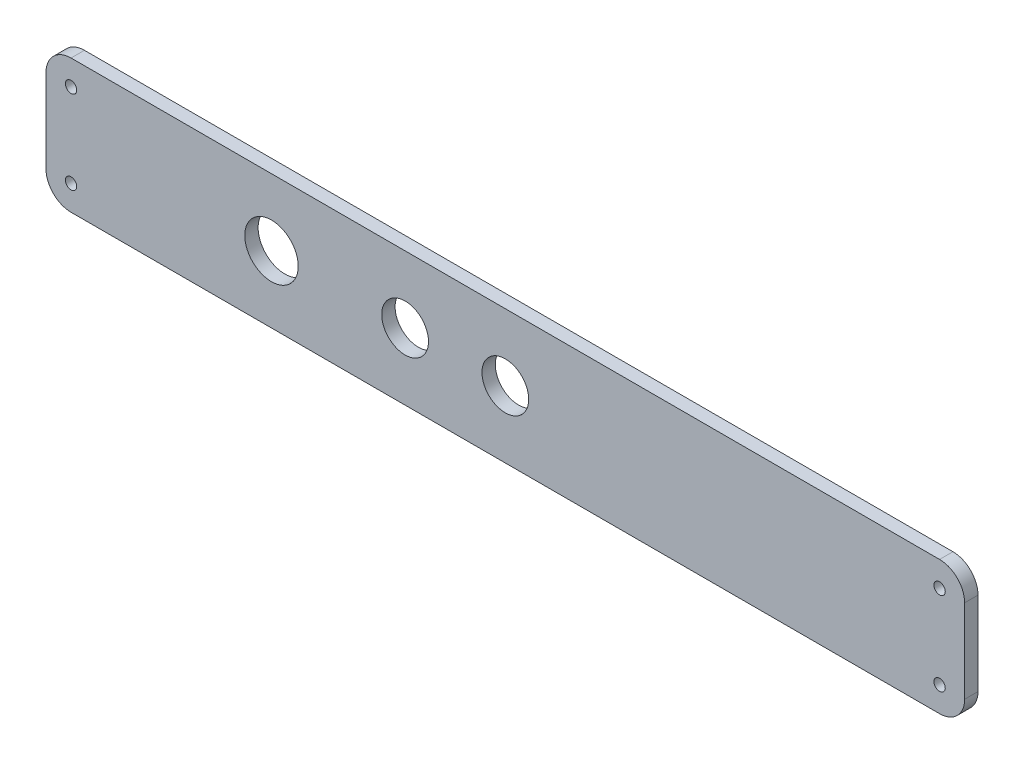
ISO-10303-21;
HEADER;
FILE_DESCRIPTION(('STEP AP214'),'2;1');
FILE_NAME('part.step','',(''),(''),'','','');
FILE_SCHEMA(('AUTOMOTIVE_DESIGN { 1 0 10303 214 1 1 1 1 }'));
ENDSEC;
DATA;
#1=APPLICATION_CONTEXT('core data for automotive mechanical design processes');
#2=APPLICATION_PROTOCOL_DEFINITION('international standard','automotive_design',2000,#1);
#3=PRODUCT_CONTEXT('',#1,'mechanical');
#4=PRODUCT('Part','Part','',(#3));
#5=PRODUCT_RELATED_PRODUCT_CATEGORY('part','',(#4));
#6=PRODUCT_DEFINITION_FORMATION('','',#4);
#7=PRODUCT_DEFINITION_CONTEXT('part definition',#1,'design');
#8=PRODUCT_DEFINITION('design','',#6,#7);
#9=PRODUCT_DEFINITION_SHAPE('','',#8);
#10=(LENGTH_UNIT() NAMED_UNIT(*) SI_UNIT(.MILLI.,.METRE.));
#11=(NAMED_UNIT(*) PLANE_ANGLE_UNIT() SI_UNIT($,.RADIAN.));
#12=(NAMED_UNIT(*) SI_UNIT($,.STERADIAN.) SOLID_ANGLE_UNIT());
#13=UNCERTAINTY_MEASURE_WITH_UNIT(LENGTH_MEASURE(1.E-05),#10,'distance_accuracy_value','');
#14=(GEOMETRIC_REPRESENTATION_CONTEXT(3) GLOBAL_UNCERTAINTY_ASSIGNED_CONTEXT((#13)) GLOBAL_UNIT_ASSIGNED_CONTEXT((#10,
#11,#12)) REPRESENTATION_CONTEXT('',''));
#15=CARTESIAN_POINT('',(0.,0.,0.));
#16=DIRECTION('',(0.,0.,1.));
#17=DIRECTION('',(1.,0.,0.));
#18=AXIS2_PLACEMENT_3D('',#15,#16,#17);
#19=CARTESIAN_POINT('',(0.,0.,0.));
#20=DIRECTION('',(0.,0.,-1.));
#21=DIRECTION('',(-1.,0.,0.));
#22=AXIS2_PLACEMENT_3D('',#19,#20,#21);
#23=PLANE('',#22);
#24=CARTESIAN_POINT('',(-267.5,32.5,0.));
#25=DIRECTION('',(0.,0.,1.));
#26=DIRECTION('',(1.,0.,0.));
#27=AXIS2_PLACEMENT_3D('',#24,#25,#26);
#28=CIRCLE('',#27,1.69999999999998);
#29=CARTESIAN_POINT('',(-265.8,32.5,0.));
#30=VERTEX_POINT('',#29);
#31=EDGE_CURVE('E222',#30,#30,#28,.T.);
#32=ORIENTED_EDGE('',*,*,#31,.T.);
#33=EDGE_LOOP('',(#32));
#34=FACE_BOUND('',#33,.T.);
#35=CARTESIAN_POINT('',(-267.5,7.49999999999998,0.));
#36=DIRECTION('',(0.,0.,1.));
#37=DIRECTION('',(1.,0.,0.));
#38=AXIS2_PLACEMENT_3D('',#35,#36,#37);
#39=CIRCLE('',#38,1.69999999999998);
#40=CARTESIAN_POINT('',(-265.8,7.49999999999998,0.));
#41=VERTEX_POINT('',#40);
#42=EDGE_CURVE('E216',#41,#41,#39,.T.);
#43=ORIENTED_EDGE('',*,*,#42,.T.);
#44=EDGE_LOOP('',(#43));
#45=FACE_BOUND('',#44,.T.);
#46=CARTESIAN_POINT('',(-7.50000000000001,32.5,0.));
#47=DIRECTION('',(0.,0.,1.));
#48=DIRECTION('',(1.,0.,0.));
#49=AXIS2_PLACEMENT_3D('',#46,#47,#48);
#50=CIRCLE('',#49,1.7);
#51=CARTESIAN_POINT('',(-5.80000000000001,32.5,0.));
#52=VERTEX_POINT('',#51);
#53=EDGE_CURVE('E194',#52,#52,#50,.T.);
#54=ORIENTED_EDGE('',*,*,#53,.T.);
#55=EDGE_LOOP('',(#54));
#56=FACE_BOUND('',#55,.T.);
#57=CARTESIAN_POINT('',(-207.5,20.,0.));
#58=DIRECTION('',(0.,0.,1.));
#59=DIRECTION('',(1.,0.,0.));
#60=AXIS2_PLACEMENT_3D('',#57,#58,#59);
#61=CIRCLE('',#60,8.00000000000001);
#62=CARTESIAN_POINT('',(-199.5,20.,0.));
#63=VERTEX_POINT('',#62);
#64=EDGE_CURVE('E182',#63,#63,#61,.T.);
#65=ORIENTED_EDGE('',*,*,#64,.T.);
#66=EDGE_LOOP('',(#65));
#67=FACE_BOUND('',#66,.T.);
#68=CARTESIAN_POINT('',(-167.5,20.,0.));
#69=DIRECTION('',(0.,0.,1.));
#70=DIRECTION('',(1.,0.,0.));
#71=AXIS2_PLACEMENT_3D('',#68,#69,#70);
#72=CIRCLE('',#71,7.00000000000001);
#73=CARTESIAN_POINT('',(-160.5,20.,0.));
#74=VERTEX_POINT('',#73);
#75=EDGE_CURVE('E197',#74,#74,#72,.T.);
#76=ORIENTED_EDGE('',*,*,#75,.T.);
#77=EDGE_LOOP('',(#76));
#78=FACE_BOUND('',#77,.T.);
#79=CARTESIAN_POINT('',(-137.5,20.,0.));
#80=DIRECTION('',(0.,0.,1.));
#81=DIRECTION('',(1.,0.,0.));
#82=AXIS2_PLACEMENT_3D('',#79,#80,#81);
#83=CIRCLE('',#82,7.00000000000001);
#84=CARTESIAN_POINT('',(-130.5,20.,0.));
#85=VERTEX_POINT('',#84);
#86=EDGE_CURVE('E190',#85,#85,#83,.T.);
#87=ORIENTED_EDGE('',*,*,#86,.T.);
#88=EDGE_LOOP('',(#87));
#89=FACE_BOUND('',#88,.T.);
#90=DIRECTION('',(-1.,0.,0.));
#91=VECTOR('',#90,1.);
#92=CARTESIAN_POINT('',(0.,40.,0.));
#93=LINE('',#92,#91);
#94=CARTESIAN_POINT('',(-7.5,40.,0.));
#95=VERTEX_POINT('',#94);
#96=CARTESIAN_POINT('',(-267.5,40.,0.));
#97=VERTEX_POINT('',#96);
#98=EDGE_CURVE('E124',#95,#97,#93,.T.);
#99=ORIENTED_EDGE('',*,*,#98,.F.);
#100=CARTESIAN_POINT('',(-7.5,32.5,0.));
#101=DIRECTION('',(0.,0.,-1.));
#102=DIRECTION('',(-1.,0.,0.));
#103=AXIS2_PLACEMENT_3D('',#100,#101,#102);
#104=CIRCLE('',#103,7.5);
#105=CARTESIAN_POINT('',(0.,32.5,0.));
#106=VERTEX_POINT('',#105);
#107=EDGE_CURVE('E107',#95,#106,#104,.T.);
#108=ORIENTED_EDGE('',*,*,#107,.T.);
#109=DIRECTION('',(0.,1.,0.));
#110=VECTOR('',#109,1.);
#111=CARTESIAN_POINT('',(0.,0.,0.));
#112=LINE('',#111,#110);
#113=CARTESIAN_POINT('',(0.,7.5,0.));
#114=VERTEX_POINT('',#113);
#115=EDGE_CURVE('E134',#114,#106,#112,.T.);
#116=ORIENTED_EDGE('',*,*,#115,.F.);
#117=CARTESIAN_POINT('',(-7.5,7.5,0.));
#118=DIRECTION('',(0.,0.,-1.));
#119=DIRECTION('',(-1.,0.,0.));
#120=AXIS2_PLACEMENT_3D('',#117,#118,#119);
#121=CIRCLE('',#120,7.5);
#122=CARTESIAN_POINT('',(-7.5,0.,0.));
#123=VERTEX_POINT('',#122);
#124=EDGE_CURVE('E118',#114,#123,#121,.T.);
#125=ORIENTED_EDGE('',*,*,#124,.T.);
#126=DIRECTION('',(1.,0.,0.));
#127=VECTOR('',#126,1.);
#128=CARTESIAN_POINT('',(0.,0.,0.));
#129=LINE('',#128,#127);
#130=CARTESIAN_POINT('',(-267.5,0.,0.));
#131=VERTEX_POINT('',#130);
#132=EDGE_CURVE('E138',#131,#123,#129,.T.);
#133=ORIENTED_EDGE('',*,*,#132,.F.);
#134=CARTESIAN_POINT('',(-267.5,7.49999999999998,0.));
#135=DIRECTION('',(0.,0.,-1.));
#136=DIRECTION('',(-1.,0.,0.));
#137=AXIS2_PLACEMENT_3D('',#134,#135,#136);
#138=CIRCLE('',#137,7.5);
#139=CARTESIAN_POINT('',(-275.,7.49999999999998,0.));
#140=VERTEX_POINT('',#139);
#141=EDGE_CURVE('E127',#131,#140,#138,.T.);
#142=ORIENTED_EDGE('',*,*,#141,.T.);
#143=DIRECTION('',(0.,-1.,0.));
#144=VECTOR('',#143,1.);
#145=CARTESIAN_POINT('',(-275.,0.,0.));
#146=LINE('',#145,#144);
#147=CARTESIAN_POINT('',(-275.,32.5,0.));
#148=VERTEX_POINT('',#147);
#149=EDGE_CURVE('E133',#148,#140,#146,.T.);
#150=ORIENTED_EDGE('',*,*,#149,.F.);
#151=CARTESIAN_POINT('',(-267.5,32.5,0.));
#152=DIRECTION('',(0.,0.,-1.));
#153=DIRECTION('',(-1.,0.,0.));
#154=AXIS2_PLACEMENT_3D('',#151,#152,#153);
#155=CIRCLE('',#154,7.5);
#156=EDGE_CURVE('E132',#148,#97,#155,.T.);
#157=ORIENTED_EDGE('',*,*,#156,.T.);
#158=EDGE_LOOP('',(#99,#108,#116,#125,#133,#142,#150,#157));
#159=FACE_BOUND('',#158,.T.);
#160=CARTESIAN_POINT('',(-7.50000000000006,7.49999999999998,0.));
#161=DIRECTION('',(0.,0.,1.));
#162=DIRECTION('',(1.,0.,0.));
#163=AXIS2_PLACEMENT_3D('',#160,#161,#162);
#164=CIRCLE('',#163,1.7);
#165=CARTESIAN_POINT('',(-5.80000000000006,7.49999999999998,0.));
#166=VERTEX_POINT('',#165);
#167=EDGE_CURVE('E210',#166,#166,#164,.T.);
#168=ORIENTED_EDGE('',*,*,#167,.T.);
#169=EDGE_LOOP('',(#168));
#170=FACE_BOUND('',#169,.T.);
#171=ADVANCED_FACE('F41',(#34,#45,#56,#67,#78,#89,#159,#170),#23,.T.);
#172=CARTESIAN_POINT('',(0.,0.,4.));
#173=DIRECTION('',(0.,0.,-1.));
#174=DIRECTION('',(-1.,0.,0.));
#175=AXIS2_PLACEMENT_3D('',#172,#173,#174);
#176=PLANE('',#175);
#177=CARTESIAN_POINT('',(-267.5,32.5,4.));
#178=DIRECTION('',(0.,0.,1.));
#179=DIRECTION('',(1.,0.,0.));
#180=AXIS2_PLACEMENT_3D('',#177,#178,#179);
#181=CIRCLE('',#180,1.69999999999998);
#182=CARTESIAN_POINT('',(-265.8,32.5,4.));
#183=VERTEX_POINT('',#182);
#184=EDGE_CURVE('E225',#183,#183,#181,.T.);
#185=ORIENTED_EDGE('',*,*,#184,.F.);
#186=EDGE_LOOP('',(#185));
#187=FACE_BOUND('',#186,.T.);
#188=CARTESIAN_POINT('',(-267.5,7.49999999999998,4.));
#189=DIRECTION('',(0.,0.,1.));
#190=DIRECTION('',(1.,0.,0.));
#191=AXIS2_PLACEMENT_3D('',#188,#189,#190);
#192=CIRCLE('',#191,1.69999999999998);
#193=CARTESIAN_POINT('',(-265.8,7.49999999999998,4.));
#194=VERTEX_POINT('',#193);
#195=EDGE_CURVE('E219',#194,#194,#192,.T.);
#196=ORIENTED_EDGE('',*,*,#195,.F.);
#197=EDGE_LOOP('',(#196));
#198=FACE_BOUND('',#197,.T.);
#199=CARTESIAN_POINT('',(-7.50000000000006,7.49999999999998,4.));
#200=DIRECTION('',(0.,0.,1.));
#201=DIRECTION('',(1.,0.,0.));
#202=AXIS2_PLACEMENT_3D('',#199,#200,#201);
#203=CIRCLE('',#202,1.7);
#204=CARTESIAN_POINT('',(-5.80000000000006,7.49999999999998,4.));
#205=VERTEX_POINT('',#204);
#206=EDGE_CURVE('E213',#205,#205,#203,.T.);
#207=ORIENTED_EDGE('',*,*,#206,.F.);
#208=EDGE_LOOP('',(#207));
#209=FACE_BOUND('',#208,.T.);
#210=CARTESIAN_POINT('',(-207.5,20.,4.));
#211=DIRECTION('',(0.,0.,1.));
#212=DIRECTION('',(1.,0.,0.));
#213=AXIS2_PLACEMENT_3D('',#210,#211,#212);
#214=CIRCLE('',#213,8.00000000000001);
#215=CARTESIAN_POINT('',(-199.5,20.,4.));
#216=VERTEX_POINT('',#215);
#217=EDGE_CURVE('E184',#216,#216,#214,.T.);
#218=ORIENTED_EDGE('',*,*,#217,.F.);
#219=EDGE_LOOP('',(#218));
#220=FACE_BOUND('',#219,.T.);
#221=CARTESIAN_POINT('',(-167.5,20.,4.));
#222=DIRECTION('',(0.,0.,1.));
#223=DIRECTION('',(1.,0.,0.));
#224=AXIS2_PLACEMENT_3D('',#221,#222,#223);
#225=CIRCLE('',#224,7.00000000000001);
#226=CARTESIAN_POINT('',(-160.5,20.,4.));
#227=VERTEX_POINT('',#226);
#228=EDGE_CURVE('E200',#227,#227,#225,.T.);
#229=ORIENTED_EDGE('',*,*,#228,.F.);
#230=EDGE_LOOP('',(#229));
#231=FACE_BOUND('',#230,.T.);
#232=CARTESIAN_POINT('',(-137.5,20.,4.));
#233=DIRECTION('',(0.,0.,1.));
#234=DIRECTION('',(1.,0.,0.));
#235=AXIS2_PLACEMENT_3D('',#232,#233,#234);
#236=CIRCLE('',#235,7.00000000000001);
#237=CARTESIAN_POINT('',(-130.5,20.,4.));
#238=VERTEX_POINT('',#237);
#239=EDGE_CURVE('E193',#238,#238,#236,.T.);
#240=ORIENTED_EDGE('',*,*,#239,.F.);
#241=EDGE_LOOP('',(#240));
#242=FACE_BOUND('',#241,.T.);
#243=DIRECTION('',(0.,1.,0.));
#244=VECTOR('',#243,1.);
#245=CARTESIAN_POINT('',(0.,0.,4.));
#246=LINE('',#245,#244);
#247=CARTESIAN_POINT('',(0.,7.5,4.));
#248=VERTEX_POINT('',#247);
#249=CARTESIAN_POINT('',(0.,32.5,4.));
#250=VERTEX_POINT('',#249);
#251=EDGE_CURVE('E176',#248,#250,#246,.T.);
#252=ORIENTED_EDGE('',*,*,#251,.T.);
#253=CARTESIAN_POINT('',(-7.5,32.5,4.));
#254=DIRECTION('',(0.,0.,-1.));
#255=DIRECTION('',(-1.,0.,0.));
#256=AXIS2_PLACEMENT_3D('',#253,#254,#255);
#257=CIRCLE('',#256,7.5);
#258=CARTESIAN_POINT('',(-7.5,40.,4.));
#259=VERTEX_POINT('',#258);
#260=EDGE_CURVE('E155',#250,#259,#257,.F.);
#261=ORIENTED_EDGE('',*,*,#260,.T.);
#262=DIRECTION('',(-1.,0.,0.));
#263=VECTOR('',#262,1.);
#264=CARTESIAN_POINT('',(0.,40.,4.));
#265=LINE('',#264,#263);
#266=CARTESIAN_POINT('',(-267.5,40.,4.));
#267=VERTEX_POINT('',#266);
#268=EDGE_CURVE('E126',#259,#267,#265,.T.);
#269=ORIENTED_EDGE('',*,*,#268,.T.);
#270=CARTESIAN_POINT('',(-267.5,32.5,4.));
#271=DIRECTION('',(0.,0.,-1.));
#272=DIRECTION('',(-1.,0.,0.));
#273=AXIS2_PLACEMENT_3D('',#270,#271,#272);
#274=CIRCLE('',#273,7.5);
#275=CARTESIAN_POINT('',(-275.,32.5,4.));
#276=VERTEX_POINT('',#275);
#277=EDGE_CURVE('E62',#267,#276,#274,.F.);
#278=ORIENTED_EDGE('',*,*,#277,.T.);
#279=DIRECTION('',(0.,-1.,0.));
#280=VECTOR('',#279,1.);
#281=CARTESIAN_POINT('',(-275.,0.,4.));
#282=LINE('',#281,#280);
#283=CARTESIAN_POINT('',(-275.,7.49999999999998,4.));
#284=VERTEX_POINT('',#283);
#285=EDGE_CURVE('E142',#276,#284,#282,.T.);
#286=ORIENTED_EDGE('',*,*,#285,.T.);
#287=CARTESIAN_POINT('',(-267.5,7.49999999999998,4.));
#288=DIRECTION('',(0.,0.,-1.));
#289=DIRECTION('',(-1.,0.,0.));
#290=AXIS2_PLACEMENT_3D('',#287,#288,#289);
#291=CIRCLE('',#290,7.5);
#292=CARTESIAN_POINT('',(-267.5,0.,4.));
#293=VERTEX_POINT('',#292);
#294=EDGE_CURVE('E150',#284,#293,#291,.F.);
#295=ORIENTED_EDGE('',*,*,#294,.T.);
#296=DIRECTION('',(1.,0.,0.));
#297=VECTOR('',#296,1.);
#298=CARTESIAN_POINT('',(0.,0.,4.));
#299=LINE('',#298,#297);
#300=CARTESIAN_POINT('',(-7.5,0.,4.));
#301=VERTEX_POINT('',#300);
#302=EDGE_CURVE('E136',#293,#301,#299,.T.);
#303=ORIENTED_EDGE('',*,*,#302,.T.);
#304=CARTESIAN_POINT('',(-7.5,7.5,4.));
#305=DIRECTION('',(0.,0.,-1.));
#306=DIRECTION('',(-1.,0.,0.));
#307=AXIS2_PLACEMENT_3D('',#304,#305,#306);
#308=CIRCLE('',#307,7.5);
#309=EDGE_CURVE('E153',#301,#248,#308,.F.);
#310=ORIENTED_EDGE('',*,*,#309,.T.);
#311=EDGE_LOOP('',(#252,#261,#269,#278,#286,#295,#303,#310));
#312=FACE_BOUND('',#311,.T.);
#313=CARTESIAN_POINT('',(-7.50000000000001,32.5,4.));
#314=DIRECTION('',(0.,0.,1.));
#315=DIRECTION('',(1.,0.,0.));
#316=AXIS2_PLACEMENT_3D('',#313,#314,#315);
#317=CIRCLE('',#316,1.7);
#318=CARTESIAN_POINT('',(-5.80000000000001,32.5,4.));
#319=VERTEX_POINT('',#318);
#320=EDGE_CURVE('E207',#319,#319,#317,.T.);
#321=ORIENTED_EDGE('',*,*,#320,.F.);
#322=EDGE_LOOP('',(#321));
#323=FACE_BOUND('',#322,.T.);
#324=ADVANCED_FACE('F172',(#187,#198,#209,#220,#231,#242,#312,#323),#176,.F.);
#325=CARTESIAN_POINT('',(0.,0.,4.));
#326=DIRECTION('',(0.,1.,0.));
#327=DIRECTION('',(-1.,0.,0.));
#328=AXIS2_PLACEMENT_3D('',#325,#326,#327);
#329=PLANE('',#328);
#330=ORIENTED_EDGE('',*,*,#132,.T.);
#331=DIRECTION('',(0.,0.,-1.));
#332=VECTOR('',#331,1.);
#333=CARTESIAN_POINT('',(-7.5,0.,4.));
#334=LINE('',#333,#332);
#335=EDGE_CURVE('E160',#123,#301,#334,.F.);
#336=ORIENTED_EDGE('',*,*,#335,.T.);
#337=ORIENTED_EDGE('',*,*,#302,.F.);
#338=DIRECTION('',(0.,0.,-1.));
#339=VECTOR('',#338,1.);
#340=CARTESIAN_POINT('',(-267.5,0.,4.));
#341=LINE('',#340,#339);
#342=EDGE_CURVE('E157',#293,#131,#341,.T.);
#343=ORIENTED_EDGE('',*,*,#342,.T.);
#344=EDGE_LOOP('',(#330,#336,#337,#343));
#345=FACE_BOUND('',#344,.T.);
#346=ADVANCED_FACE('F166',(#345),#329,.F.);
#347=CARTESIAN_POINT('',(0.,0.,4.));
#348=DIRECTION('',(-1.,0.,0.));
#349=DIRECTION('',(0.,0.,1.));
#350=AXIS2_PLACEMENT_3D('',#347,#348,#349);
#351=PLANE('',#350);
#352=ORIENTED_EDGE('',*,*,#115,.T.);
#353=DIRECTION('',(0.,0.,-1.));
#354=VECTOR('',#353,1.);
#355=CARTESIAN_POINT('',(0.,32.5,4.));
#356=LINE('',#355,#354);
#357=EDGE_CURVE('E112',#106,#250,#356,.F.);
#358=ORIENTED_EDGE('',*,*,#357,.T.);
#359=ORIENTED_EDGE('',*,*,#251,.F.);
#360=DIRECTION('',(0.,0.,-1.));
#361=VECTOR('',#360,1.);
#362=CARTESIAN_POINT('',(0.,7.5,4.));
#363=LINE('',#362,#361);
#364=EDGE_CURVE('E117',#248,#114,#363,.T.);
#365=ORIENTED_EDGE('',*,*,#364,.T.);
#366=EDGE_LOOP('',(#352,#358,#359,#365));
#367=FACE_BOUND('',#366,.T.);
#368=ADVANCED_FACE('F181',(#367),#351,.F.);
#369=CARTESIAN_POINT('',(0.,40.,4.));
#370=DIRECTION('',(0.,-1.,0.));
#371=DIRECTION('',(1.,0.,0.));
#372=AXIS2_PLACEMENT_3D('',#369,#370,#371);
#373=PLANE('',#372);
#374=ORIENTED_EDGE('',*,*,#268,.F.);
#375=DIRECTION('',(0.,0.,-1.));
#376=VECTOR('',#375,1.);
#377=CARTESIAN_POINT('',(-7.5,40.,4.));
#378=LINE('',#377,#376);
#379=EDGE_CURVE('E111',#259,#95,#378,.T.);
#380=ORIENTED_EDGE('',*,*,#379,.T.);
#381=ORIENTED_EDGE('',*,*,#98,.T.);
#382=DIRECTION('',(0.,0.,-1.));
#383=VECTOR('',#382,1.);
#384=CARTESIAN_POINT('',(-267.5,40.,4.));
#385=LINE('',#384,#383);
#386=EDGE_CURVE('E128',#97,#267,#385,.F.);
#387=ORIENTED_EDGE('',*,*,#386,.T.);
#388=EDGE_LOOP('',(#374,#380,#381,#387));
#389=FACE_BOUND('',#388,.T.);
#390=ADVANCED_FACE('F123',(#389),#373,.F.);
#391=CARTESIAN_POINT('',(-275.,0.,4.));
#392=DIRECTION('',(1.,0.,0.));
#393=DIRECTION('',(0.,0.,-1.));
#394=AXIS2_PLACEMENT_3D('',#391,#392,#393);
#395=PLANE('',#394);
#396=ORIENTED_EDGE('',*,*,#285,.F.);
#397=DIRECTION('',(0.,0.,-1.));
#398=VECTOR('',#397,1.);
#399=CARTESIAN_POINT('',(-275.,32.5,4.));
#400=LINE('',#399,#398);
#401=EDGE_CURVE('E11',#276,#148,#400,.T.);
#402=ORIENTED_EDGE('',*,*,#401,.T.);
#403=ORIENTED_EDGE('',*,*,#149,.T.);
#404=DIRECTION('',(0.,0.,-1.));
#405=VECTOR('',#404,1.);
#406=CARTESIAN_POINT('',(-275.,7.49999999999998,4.));
#407=LINE('',#406,#405);
#408=EDGE_CURVE('E49',#140,#284,#407,.F.);
#409=ORIENTED_EDGE('',*,*,#408,.T.);
#410=EDGE_LOOP('',(#396,#402,#403,#409));
#411=FACE_BOUND('',#410,.T.);
#412=ADVANCED_FACE('F247',(#411),#395,.F.);
#413=CARTESIAN_POINT('',(-137.5,20.,0.));
#414=DIRECTION('',(0.,0.,1.));
#415=DIRECTION('',(1.,0.,0.));
#416=AXIS2_PLACEMENT_3D('',#413,#414,#415);
#417=CYLINDRICAL_SURFACE('',#416,7.00000000000001);
#418=ORIENTED_EDGE('',*,*,#86,.F.);
#419=EDGE_LOOP('',(#418));
#420=FACE_BOUND('',#419,.T.);
#421=ORIENTED_EDGE('',*,*,#239,.T.);
#422=EDGE_LOOP('',(#421));
#423=FACE_BOUND('',#422,.T.);
#424=ADVANCED_FACE('F244',(#420,#423),#417,.F.);
#425=CARTESIAN_POINT('',(-167.5,20.,0.));
#426=DIRECTION('',(0.,0.,1.));
#427=DIRECTION('',(1.,0.,0.));
#428=AXIS2_PLACEMENT_3D('',#425,#426,#427);
#429=CYLINDRICAL_SURFACE('',#428,7.00000000000001);
#430=ORIENTED_EDGE('',*,*,#75,.F.);
#431=EDGE_LOOP('',(#430));
#432=FACE_BOUND('',#431,.T.);
#433=ORIENTED_EDGE('',*,*,#228,.T.);
#434=EDGE_LOOP('',(#433));
#435=FACE_BOUND('',#434,.T.);
#436=ADVANCED_FACE('F246',(#432,#435),#429,.F.);
#437=CARTESIAN_POINT('',(-207.5,20.,0.));
#438=DIRECTION('',(0.,0.,1.));
#439=DIRECTION('',(1.,0.,0.));
#440=AXIS2_PLACEMENT_3D('',#437,#438,#439);
#441=CYLINDRICAL_SURFACE('',#440,8.00000000000001);
#442=ORIENTED_EDGE('',*,*,#64,.F.);
#443=EDGE_LOOP('',(#442));
#444=FACE_BOUND('',#443,.T.);
#445=ORIENTED_EDGE('',*,*,#217,.T.);
#446=EDGE_LOOP('',(#445));
#447=FACE_BOUND('',#446,.T.);
#448=ADVANCED_FACE('F253',(#444,#447),#441,.F.);
#449=CARTESIAN_POINT('',(-7.50000000000001,32.5,4.));
#450=DIRECTION('',(0.,0.,1.));
#451=DIRECTION('',(1.,0.,0.));
#452=AXIS2_PLACEMENT_3D('',#449,#450,#451);
#453=CYLINDRICAL_SURFACE('',#452,1.7);
#454=ORIENTED_EDGE('',*,*,#53,.F.);
#455=EDGE_LOOP('',(#454));
#456=FACE_BOUND('',#455,.T.);
#457=ORIENTED_EDGE('',*,*,#320,.T.);
#458=EDGE_LOOP('',(#457));
#459=FACE_BOUND('',#458,.T.);
#460=ADVANCED_FACE('F331',(#456,#459),#453,.F.);
#461=CARTESIAN_POINT('',(-7.50000000000006,7.49999999999998,4.));
#462=DIRECTION('',(0.,0.,1.));
#463=DIRECTION('',(1.,0.,0.));
#464=AXIS2_PLACEMENT_3D('',#461,#462,#463);
#465=CYLINDRICAL_SURFACE('',#464,1.7);
#466=ORIENTED_EDGE('',*,*,#167,.F.);
#467=EDGE_LOOP('',(#466));
#468=FACE_BOUND('',#467,.T.);
#469=ORIENTED_EDGE('',*,*,#206,.T.);
#470=EDGE_LOOP('',(#469));
#471=FACE_BOUND('',#470,.T.);
#472=ADVANCED_FACE('F321',(#468,#471),#465,.F.);
#473=CARTESIAN_POINT('',(-267.5,7.49999999999998,4.));
#474=DIRECTION('',(0.,0.,1.));
#475=DIRECTION('',(1.,0.,0.));
#476=AXIS2_PLACEMENT_3D('',#473,#474,#475);
#477=CYLINDRICAL_SURFACE('',#476,1.69999999999998);
#478=ORIENTED_EDGE('',*,*,#42,.F.);
#479=EDGE_LOOP('',(#478));
#480=FACE_BOUND('',#479,.T.);
#481=ORIENTED_EDGE('',*,*,#195,.T.);
#482=EDGE_LOOP('',(#481));
#483=FACE_BOUND('',#482,.T.);
#484=ADVANCED_FACE('F311',(#480,#483),#477,.F.);
#485=CARTESIAN_POINT('',(-267.5,32.5,4.));
#486=DIRECTION('',(0.,0.,1.));
#487=DIRECTION('',(1.,0.,0.));
#488=AXIS2_PLACEMENT_3D('',#485,#486,#487);
#489=CYLINDRICAL_SURFACE('',#488,1.69999999999998);
#490=ORIENTED_EDGE('',*,*,#31,.F.);
#491=EDGE_LOOP('',(#490));
#492=FACE_BOUND('',#491,.T.);
#493=ORIENTED_EDGE('',*,*,#184,.T.);
#494=EDGE_LOOP('',(#493));
#495=FACE_BOUND('',#494,.T.);
#496=ADVANCED_FACE('F229',(#492,#495),#489,.F.);
#497=CARTESIAN_POINT('',(-7.5,32.5,4.));
#498=DIRECTION('',(0.,0.,-1.));
#499=DIRECTION('',(-1.,0.,0.));
#500=AXIS2_PLACEMENT_3D('',#497,#498,#499);
#501=CYLINDRICAL_SURFACE('',#500,7.5);
#502=ORIENTED_EDGE('',*,*,#260,.F.);
#503=ORIENTED_EDGE('',*,*,#357,.F.);
#504=ORIENTED_EDGE('',*,*,#107,.F.);
#505=ORIENTED_EDGE('',*,*,#379,.F.);
#506=EDGE_LOOP('',(#502,#503,#504,#505));
#507=FACE_BOUND('',#506,.T.);
#508=ADVANCED_FACE('F110',(#507),#501,.T.);
#509=CARTESIAN_POINT('',(-7.5,7.5,4.));
#510=DIRECTION('',(0.,0.,-1.));
#511=DIRECTION('',(-1.,0.,0.));
#512=AXIS2_PLACEMENT_3D('',#509,#510,#511);
#513=CYLINDRICAL_SURFACE('',#512,7.5);
#514=ORIENTED_EDGE('',*,*,#309,.F.);
#515=ORIENTED_EDGE('',*,*,#335,.F.);
#516=ORIENTED_EDGE('',*,*,#124,.F.);
#517=ORIENTED_EDGE('',*,*,#364,.F.);
#518=EDGE_LOOP('',(#514,#515,#516,#517));
#519=FACE_BOUND('',#518,.T.);
#520=ADVANCED_FACE('F179',(#519),#513,.T.);
#521=CARTESIAN_POINT('',(-267.5,32.5,4.));
#522=DIRECTION('',(0.,0.,-1.));
#523=DIRECTION('',(-1.,0.,0.));
#524=AXIS2_PLACEMENT_3D('',#521,#522,#523);
#525=CYLINDRICAL_SURFACE('',#524,7.5);
#526=ORIENTED_EDGE('',*,*,#277,.F.);
#527=ORIENTED_EDGE('',*,*,#386,.F.);
#528=ORIENTED_EDGE('',*,*,#156,.F.);
#529=ORIENTED_EDGE('',*,*,#401,.F.);
#530=EDGE_LOOP('',(#526,#527,#528,#529));
#531=FACE_BOUND('',#530,.T.);
#532=ADVANCED_FACE('F276',(#531),#525,.T.);
#533=CARTESIAN_POINT('',(-267.5,7.49999999999998,4.));
#534=DIRECTION('',(0.,0.,-1.));
#535=DIRECTION('',(-1.,0.,0.));
#536=AXIS2_PLACEMENT_3D('',#533,#534,#535);
#537=CYLINDRICAL_SURFACE('',#536,7.5);
#538=ORIENTED_EDGE('',*,*,#294,.F.);
#539=ORIENTED_EDGE('',*,*,#408,.F.);
#540=ORIENTED_EDGE('',*,*,#141,.F.);
#541=ORIENTED_EDGE('',*,*,#342,.F.);
#542=EDGE_LOOP('',(#538,#539,#540,#541));
#543=FACE_BOUND('',#542,.T.);
#544=ADVANCED_FACE('F43',(#543),#537,.T.);
#545=CLOSED_SHELL('',(#171,#324,#346,#368,#390,#412,#424,#436,#448,#460,#472,#484,#496,#508,
#520,#532,#544));
#546=MANIFOLD_SOLID_BREP('B2',#545);
#547=ADVANCED_BREP_SHAPE_REPRESENTATION('',(#18,#546),#14);
#548=SHAPE_DEFINITION_REPRESENTATION(#9,#547);
ENDSEC;
END-ISO-10303-21;
